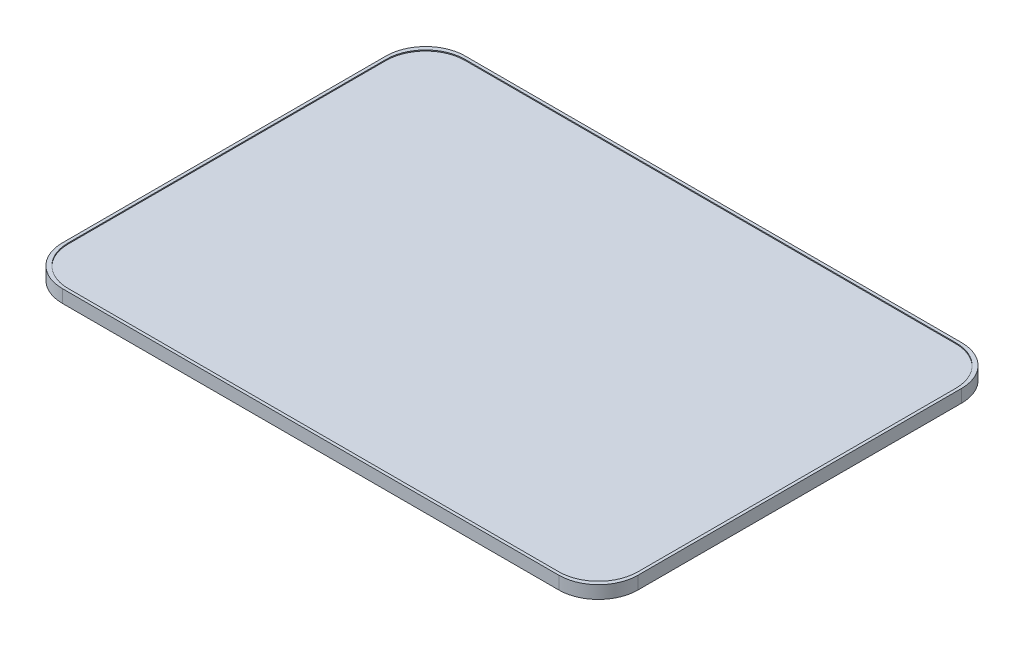
ISO-10303-21;
HEADER;
FILE_DESCRIPTION(('STEP AP214'),'2;1');
FILE_NAME('part.step','',(''),(''),'','','');
FILE_SCHEMA(('AUTOMOTIVE_DESIGN { 1 0 10303 214 1 1 1 1 }'));
ENDSEC;
DATA;
#1=APPLICATION_CONTEXT('core data for automotive mechanical design processes');
#2=APPLICATION_PROTOCOL_DEFINITION('international standard','automotive_design',2000,#1);
#3=PRODUCT_CONTEXT('',#1,'mechanical');
#4=PRODUCT('Part','Part','',(#3));
#5=PRODUCT_RELATED_PRODUCT_CATEGORY('part','',(#4));
#6=PRODUCT_DEFINITION_FORMATION('','',#4);
#7=PRODUCT_DEFINITION_CONTEXT('part definition',#1,'design');
#8=PRODUCT_DEFINITION('design','',#6,#7);
#9=PRODUCT_DEFINITION_SHAPE('','',#8);
#10=(LENGTH_UNIT() NAMED_UNIT(*) SI_UNIT(.MILLI.,.METRE.));
#11=(NAMED_UNIT(*) PLANE_ANGLE_UNIT() SI_UNIT($,.RADIAN.));
#12=(NAMED_UNIT(*) SI_UNIT($,.STERADIAN.) SOLID_ANGLE_UNIT());
#13=UNCERTAINTY_MEASURE_WITH_UNIT(LENGTH_MEASURE(1.E-05),#10,'distance_accuracy_value','');
#14=(GEOMETRIC_REPRESENTATION_CONTEXT(3) GLOBAL_UNCERTAINTY_ASSIGNED_CONTEXT((#13)) GLOBAL_UNIT_ASSIGNED_CONTEXT((#10,
#11,#12)) REPRESENTATION_CONTEXT('',''));
#15=CARTESIAN_POINT('',(0.,0.,0.));
#16=DIRECTION('',(0.,0.,1.));
#17=DIRECTION('',(1.,0.,0.));
#18=AXIS2_PLACEMENT_3D('',#15,#16,#17);
#19=CARTESIAN_POINT('',(291.5,11.,204.));
#20=DIRECTION('',(-1.,0.,0.));
#21=DIRECTION('',(0.,0.,1.));
#22=AXIS2_PLACEMENT_3D('',#19,#20,#21);
#23=PLANE('',#22);
#24=DIRECTION('',(0.,0.,1.));
#25=VECTOR('',#24,1.);
#26=CARTESIAN_POINT('',(291.5,-1.,-204.));
#27=LINE('',#26,#25);
#28=CARTESIAN_POINT('',(291.5,-1.,-164.));
#29=VERTEX_POINT('',#28);
#30=CARTESIAN_POINT('',(291.5,-1.,164.));
#31=VERTEX_POINT('',#30);
#32=EDGE_CURVE('E344',#29,#31,#27,.T.);
#33=ORIENTED_EDGE('',*,*,#32,.F.);
#34=DIRECTION('',(0.,-1.,0.));
#35=VECTOR('',#34,1.);
#36=CARTESIAN_POINT('',(291.5,11.,-164.));
#37=LINE('',#36,#35);
#38=CARTESIAN_POINT('',(291.5,12.,-164.));
#39=VERTEX_POINT('',#38);
#40=EDGE_CURVE('E263',#29,#39,#37,.F.);
#41=ORIENTED_EDGE('',*,*,#40,.T.);
#42=DIRECTION('',(0.,0.,-1.));
#43=VECTOR('',#42,1.);
#44=CARTESIAN_POINT('',(291.5,12.,204.));
#45=LINE('',#44,#43);
#46=CARTESIAN_POINT('',(291.5,12.,164.));
#47=VERTEX_POINT('',#46);
#48=EDGE_CURVE('E227',#47,#39,#45,.T.);
#49=ORIENTED_EDGE('',*,*,#48,.F.);
#50=DIRECTION('',(0.,-1.,0.));
#51=VECTOR('',#50,1.);
#52=CARTESIAN_POINT('',(291.5,11.,164.));
#53=LINE('',#52,#51);
#54=EDGE_CURVE('E260',#47,#31,#53,.T.);
#55=ORIENTED_EDGE('',*,*,#54,.T.);
#56=EDGE_LOOP('',(#33,#41,#49,#55));
#57=FACE_BOUND('',#56,.T.);
#58=ADVANCED_FACE('F36',(#57),#23,.F.);
#59=CARTESIAN_POINT('',(-291.5,11.,-204.));
#60=DIRECTION('',(0.,0.,1.));
#61=DIRECTION('',(1.,0.,0.));
#62=AXIS2_PLACEMENT_3D('',#59,#60,#61);
#63=PLANE('',#62);
#64=DIRECTION('',(1.,0.,0.));
#65=VECTOR('',#64,1.);
#66=CARTESIAN_POINT('',(291.5,-1.,-204.));
#67=LINE('',#66,#65);
#68=CARTESIAN_POINT('',(-251.5,-1.,-204.));
#69=VERTEX_POINT('',#68);
#70=CARTESIAN_POINT('',(251.5,-1.,-204.));
#71=VERTEX_POINT('',#70);
#72=EDGE_CURVE('E345',#69,#71,#67,.T.);
#73=ORIENTED_EDGE('',*,*,#72,.F.);
#74=DIRECTION('',(0.,-1.,0.));
#75=VECTOR('',#74,1.);
#76=CARTESIAN_POINT('',(-251.5,11.,-204.));
#77=LINE('',#76,#75);
#78=CARTESIAN_POINT('',(-251.5,12.,-204.));
#79=VERTEX_POINT('',#78);
#80=EDGE_CURVE('E258',#69,#79,#77,.F.);
#81=ORIENTED_EDGE('',*,*,#80,.T.);
#82=DIRECTION('',(-1.,0.,0.));
#83=VECTOR('',#82,1.);
#84=CARTESIAN_POINT('',(291.5,12.,-204.));
#85=LINE('',#84,#83);
#86=CARTESIAN_POINT('',(251.5,12.,-204.));
#87=VERTEX_POINT('',#86);
#88=EDGE_CURVE('E223',#87,#79,#85,.T.);
#89=ORIENTED_EDGE('',*,*,#88,.F.);
#90=DIRECTION('',(0.,-1.,0.));
#91=VECTOR('',#90,1.);
#92=CARTESIAN_POINT('',(251.5,11.,-204.));
#93=LINE('',#92,#91);
#94=EDGE_CURVE('E255',#87,#71,#93,.T.);
#95=ORIENTED_EDGE('',*,*,#94,.T.);
#96=EDGE_LOOP('',(#73,#81,#89,#95));
#97=FACE_BOUND('',#96,.T.);
#98=ADVANCED_FACE('F334',(#97),#63,.F.);
#99=CARTESIAN_POINT('',(-291.5,11.,204.));
#100=DIRECTION('',(1.,0.,0.));
#101=DIRECTION('',(0.,0.,-1.));
#102=AXIS2_PLACEMENT_3D('',#99,#100,#101);
#103=PLANE('',#102);
#104=DIRECTION('',(0.,0.,1.));
#105=VECTOR('',#104,1.);
#106=CARTESIAN_POINT('',(-291.5,12.,204.));
#107=LINE('',#106,#105);
#108=CARTESIAN_POINT('',(-291.5,12.,-164.));
#109=VERTEX_POINT('',#108);
#110=CARTESIAN_POINT('',(-291.5,12.,164.));
#111=VERTEX_POINT('',#110);
#112=EDGE_CURVE('E369',#109,#111,#107,.T.);
#113=ORIENTED_EDGE('',*,*,#112,.F.);
#114=DIRECTION('',(0.,-1.,0.));
#115=VECTOR('',#114,1.);
#116=CARTESIAN_POINT('',(-291.5,11.,-164.));
#117=LINE('',#116,#115);
#118=CARTESIAN_POINT('',(-291.5,-1.,-164.));
#119=VERTEX_POINT('',#118);
#120=EDGE_CURVE('E252',#109,#119,#117,.T.);
#121=ORIENTED_EDGE('',*,*,#120,.T.);
#122=DIRECTION('',(0.,0.,-1.));
#123=VECTOR('',#122,1.);
#124=CARTESIAN_POINT('',(-291.5,-1.,-204.));
#125=LINE('',#124,#123);
#126=CARTESIAN_POINT('',(-291.5,-1.,164.));
#127=VERTEX_POINT('',#126);
#128=EDGE_CURVE('E353',#127,#119,#125,.T.);
#129=ORIENTED_EDGE('',*,*,#128,.F.);
#130=DIRECTION('',(0.,-1.,0.));
#131=VECTOR('',#130,1.);
#132=CARTESIAN_POINT('',(-291.5,11.,164.));
#133=LINE('',#132,#131);
#134=EDGE_CURVE('E250',#127,#111,#133,.F.);
#135=ORIENTED_EDGE('',*,*,#134,.T.);
#136=EDGE_LOOP('',(#113,#121,#129,#135));
#137=FACE_BOUND('',#136,.T.);
#138=ADVANCED_FACE('F399',(#137),#103,.F.);
#139=CARTESIAN_POINT('',(-291.5,11.,204.));
#140=DIRECTION('',(0.,0.,-1.));
#141=DIRECTION('',(-1.,0.,0.));
#142=AXIS2_PLACEMENT_3D('',#139,#140,#141);
#143=PLANE('',#142);
#144=DIRECTION('',(1.,0.,0.));
#145=VECTOR('',#144,1.);
#146=CARTESIAN_POINT('',(291.5,12.,204.));
#147=LINE('',#146,#145);
#148=CARTESIAN_POINT('',(-251.5,12.,204.));
#149=VERTEX_POINT('',#148);
#150=CARTESIAN_POINT('',(251.5,12.,204.));
#151=VERTEX_POINT('',#150);
#152=EDGE_CURVE('E382',#149,#151,#147,.T.);
#153=ORIENTED_EDGE('',*,*,#152,.F.);
#154=DIRECTION('',(0.,-1.,0.));
#155=VECTOR('',#154,1.);
#156=CARTESIAN_POINT('',(-251.5,11.,204.));
#157=LINE('',#156,#155);
#158=CARTESIAN_POINT('',(-251.5,-1.,204.));
#159=VERTEX_POINT('',#158);
#160=EDGE_CURVE('E267',#149,#159,#157,.T.);
#161=ORIENTED_EDGE('',*,*,#160,.T.);
#162=DIRECTION('',(-1.,0.,0.));
#163=VECTOR('',#162,1.);
#164=CARTESIAN_POINT('',(291.5,-1.,204.));
#165=LINE('',#164,#163);
#166=CARTESIAN_POINT('',(251.5,-1.,204.));
#167=VERTEX_POINT('',#166);
#168=EDGE_CURVE('E348',#167,#159,#165,.T.);
#169=ORIENTED_EDGE('',*,*,#168,.F.);
#170=DIRECTION('',(0.,-1.,0.));
#171=VECTOR('',#170,1.);
#172=CARTESIAN_POINT('',(251.5,11.,204.));
#173=LINE('',#172,#171);
#174=EDGE_CURVE('E265',#167,#151,#173,.F.);
#175=ORIENTED_EDGE('',*,*,#174,.T.);
#176=EDGE_LOOP('',(#153,#161,#169,#175));
#177=FACE_BOUND('',#176,.T.);
#178=ADVANCED_FACE('F392',(#177),#143,.F.);
#179=CARTESIAN_POINT('',(0.,12.,0.));
#180=DIRECTION('',(0.,1.,0.));
#181=DIRECTION('',(0.,0.,1.));
#182=AXIS2_PLACEMENT_3D('',#179,#180,#181);
#183=PLANE('',#182);
#184=ORIENTED_EDGE('',*,*,#88,.T.);
#185=CARTESIAN_POINT('',(-251.5,12.,-164.));
#186=DIRECTION('',(0.,1.,0.));
#187=DIRECTION('',(0.,0.,1.));
#188=AXIS2_PLACEMENT_3D('',#185,#186,#187);
#189=CIRCLE('',#188,40.);
#190=EDGE_CURVE('E11',#79,#109,#189,.T.);
#191=ORIENTED_EDGE('',*,*,#190,.T.);
#192=ORIENTED_EDGE('',*,*,#112,.T.);
#193=CARTESIAN_POINT('',(-251.5,12.,164.));
#194=DIRECTION('',(0.,1.,0.));
#195=DIRECTION('',(0.,0.,1.));
#196=AXIS2_PLACEMENT_3D('',#193,#194,#195);
#197=CIRCLE('',#196,40.);
#198=EDGE_CURVE('E321',#111,#149,#197,.T.);
#199=ORIENTED_EDGE('',*,*,#198,.T.);
#200=ORIENTED_EDGE('',*,*,#152,.T.);
#201=CARTESIAN_POINT('',(251.5,12.,164.));
#202=DIRECTION('',(0.,1.,0.));
#203=DIRECTION('',(0.,0.,1.));
#204=AXIS2_PLACEMENT_3D('',#201,#202,#203);
#205=CIRCLE('',#204,40.);
#206=EDGE_CURVE('E319',#151,#47,#205,.T.);
#207=ORIENTED_EDGE('',*,*,#206,.T.);
#208=ORIENTED_EDGE('',*,*,#48,.T.);
#209=CARTESIAN_POINT('',(251.5,12.,-164.));
#210=DIRECTION('',(0.,1.,0.));
#211=DIRECTION('',(0.,0.,1.));
#212=AXIS2_PLACEMENT_3D('',#209,#210,#211);
#213=CIRCLE('',#212,40.);
#214=EDGE_CURVE('E44',#39,#87,#213,.T.);
#215=ORIENTED_EDGE('',*,*,#214,.T.);
#216=EDGE_LOOP('',(#184,#191,#192,#199,#200,#207,#208,#215));
#217=FACE_BOUND('',#216,.T.);
#218=DIRECTION('',(1.,0.,0.));
#219=VECTOR('',#218,1.);
#220=CARTESIAN_POINT('',(288.5,12.,201.));
#221=LINE('',#220,#219);
#222=CARTESIAN_POINT('',(-248.5,12.,201.));
#223=VERTEX_POINT('',#222);
#224=CARTESIAN_POINT('',(248.5,12.,201.));
#225=VERTEX_POINT('',#224);
#226=EDGE_CURVE('E360',#223,#225,#221,.T.);
#227=ORIENTED_EDGE('',*,*,#226,.F.);
#228=CARTESIAN_POINT('',(-248.5,12.,161.));
#229=DIRECTION('',(0.,1.,0.));
#230=DIRECTION('',(0.,0.,1.));
#231=AXIS2_PLACEMENT_3D('',#228,#229,#230);
#232=CIRCLE('',#231,40.);
#233=CARTESIAN_POINT('',(-288.5,12.,161.));
#234=VERTEX_POINT('',#233);
#235=EDGE_CURVE('E303',#223,#234,#232,.F.);
#236=ORIENTED_EDGE('',*,*,#235,.T.);
#237=DIRECTION('',(0.,0.,1.));
#238=VECTOR('',#237,1.);
#239=CARTESIAN_POINT('',(-288.5,12.,201.));
#240=LINE('',#239,#238);
#241=CARTESIAN_POINT('',(-288.5,12.,-161.));
#242=VERTEX_POINT('',#241);
#243=EDGE_CURVE('E357',#242,#234,#240,.T.);
#244=ORIENTED_EDGE('',*,*,#243,.F.);
#245=CARTESIAN_POINT('',(-248.5,12.,-161.));
#246=DIRECTION('',(0.,1.,0.));
#247=DIRECTION('',(0.,0.,1.));
#248=AXIS2_PLACEMENT_3D('',#245,#246,#247);
#249=CIRCLE('',#248,40.);
#250=CARTESIAN_POINT('',(-248.5,12.,-201.));
#251=VERTEX_POINT('',#250);
#252=EDGE_CURVE('E51',#242,#251,#249,.F.);
#253=ORIENTED_EDGE('',*,*,#252,.T.);
#254=DIRECTION('',(-1.,0.,0.));
#255=VECTOR('',#254,1.);
#256=CARTESIAN_POINT('',(288.5,12.,-201.));
#257=LINE('',#256,#255);
#258=CARTESIAN_POINT('',(248.5,12.,-201.));
#259=VERTEX_POINT('',#258);
#260=EDGE_CURVE('E367',#259,#251,#257,.T.);
#261=ORIENTED_EDGE('',*,*,#260,.F.);
#262=CARTESIAN_POINT('',(248.5,12.,-161.));
#263=DIRECTION('',(0.,1.,0.));
#264=DIRECTION('',(0.,0.,1.));
#265=AXIS2_PLACEMENT_3D('',#262,#263,#264);
#266=CIRCLE('',#265,40.);
#267=CARTESIAN_POINT('',(288.5,12.,-161.));
#268=VERTEX_POINT('',#267);
#269=EDGE_CURVE('E305',#259,#268,#266,.F.);
#270=ORIENTED_EDGE('',*,*,#269,.T.);
#271=DIRECTION('',(0.,0.,-1.));
#272=VECTOR('',#271,1.);
#273=CARTESIAN_POINT('',(288.5,12.,201.));
#274=LINE('',#273,#272);
#275=CARTESIAN_POINT('',(288.5,12.,161.));
#276=VERTEX_POINT('',#275);
#277=EDGE_CURVE('E364',#276,#268,#274,.T.);
#278=ORIENTED_EDGE('',*,*,#277,.F.);
#279=CARTESIAN_POINT('',(248.5,12.,161.));
#280=DIRECTION('',(0.,1.,0.));
#281=DIRECTION('',(0.,0.,1.));
#282=AXIS2_PLACEMENT_3D('',#279,#280,#281);
#283=CIRCLE('',#282,40.);
#284=EDGE_CURVE('E309',#276,#225,#283,.F.);
#285=ORIENTED_EDGE('',*,*,#284,.T.);
#286=EDGE_LOOP('',(#227,#236,#244,#253,#261,#270,#278,#285));
#287=FACE_BOUND('',#286,.T.);
#288=ADVANCED_FACE('F326',(#217,#287),#183,.T.);
#289=CARTESIAN_POINT('',(-288.5,12.,201.));
#290=DIRECTION('',(1.,0.,0.));
#291=DIRECTION('',(0.,0.,-1.));
#292=AXIS2_PLACEMENT_3D('',#289,#290,#291);
#293=PLANE('',#292);
#294=ORIENTED_EDGE('',*,*,#243,.T.);
#295=DIRECTION('',(0.,-1.,0.));
#296=VECTOR('',#295,1.);
#297=CARTESIAN_POINT('',(-288.5,11.,161.));
#298=LINE('',#297,#296);
#299=CARTESIAN_POINT('',(-288.5,11.,161.));
#300=VERTEX_POINT('',#299);
#301=EDGE_CURVE('E272',#234,#300,#298,.T.);
#302=ORIENTED_EDGE('',*,*,#301,.T.);
#303=DIRECTION('',(0.,0.,1.));
#304=VECTOR('',#303,1.);
#305=CARTESIAN_POINT('',(-288.5,11.,201.));
#306=LINE('',#305,#304);
#307=CARTESIAN_POINT('',(-288.5,11.,-161.));
#308=VERTEX_POINT('',#307);
#309=EDGE_CURVE('E351',#308,#300,#306,.T.);
#310=ORIENTED_EDGE('',*,*,#309,.F.);
#311=DIRECTION('',(0.,-1.,0.));
#312=VECTOR('',#311,1.);
#313=CARTESIAN_POINT('',(-288.5,12.,-161.));
#314=LINE('',#313,#312);
#315=EDGE_CURVE('E270',#308,#242,#314,.F.);
#316=ORIENTED_EDGE('',*,*,#315,.T.);
#317=EDGE_LOOP('',(#294,#302,#310,#316));
#318=FACE_BOUND('',#317,.T.);
#319=ADVANCED_FACE('F470',(#318),#293,.T.);
#320=CARTESIAN_POINT('',(288.5,12.,201.));
#321=DIRECTION('',(0.,0.,-1.));
#322=DIRECTION('',(-1.,0.,0.));
#323=AXIS2_PLACEMENT_3D('',#320,#321,#322);
#324=PLANE('',#323);
#325=DIRECTION('',(1.,0.,0.));
#326=VECTOR('',#325,1.);
#327=CARTESIAN_POINT('',(288.5,11.,201.));
#328=LINE('',#327,#326);
#329=CARTESIAN_POINT('',(-248.5,11.,201.));
#330=VERTEX_POINT('',#329);
#331=CARTESIAN_POINT('',(248.5,11.,201.));
#332=VERTEX_POINT('',#331);
#333=EDGE_CURVE('E372',#330,#332,#328,.T.);
#334=ORIENTED_EDGE('',*,*,#333,.F.);
#335=DIRECTION('',(0.,-1.,0.));
#336=VECTOR('',#335,1.);
#337=CARTESIAN_POINT('',(-248.5,12.,201.));
#338=LINE('',#337,#336);
#339=EDGE_CURVE('E286',#330,#223,#338,.F.);
#340=ORIENTED_EDGE('',*,*,#339,.T.);
#341=ORIENTED_EDGE('',*,*,#226,.T.);
#342=DIRECTION('',(0.,-1.,0.));
#343=VECTOR('',#342,1.);
#344=CARTESIAN_POINT('',(248.5,11.,201.));
#345=LINE('',#344,#343);
#346=EDGE_CURVE('E283',#225,#332,#345,.T.);
#347=ORIENTED_EDGE('',*,*,#346,.T.);
#348=EDGE_LOOP('',(#334,#340,#341,#347));
#349=FACE_BOUND('',#348,.T.);
#350=ADVANCED_FACE('F473',(#349),#324,.T.);
#351=CARTESIAN_POINT('',(288.5,12.,201.));
#352=DIRECTION('',(-1.,0.,0.));
#353=DIRECTION('',(0.,0.,1.));
#354=AXIS2_PLACEMENT_3D('',#351,#352,#353);
#355=PLANE('',#354);
#356=ORIENTED_EDGE('',*,*,#277,.T.);
#357=DIRECTION('',(0.,-1.,0.));
#358=VECTOR('',#357,1.);
#359=CARTESIAN_POINT('',(288.5,11.,-161.));
#360=LINE('',#359,#358);
#361=CARTESIAN_POINT('',(288.5,11.,-161.));
#362=VERTEX_POINT('',#361);
#363=EDGE_CURVE('E290',#268,#362,#360,.T.);
#364=ORIENTED_EDGE('',*,*,#363,.T.);
#365=DIRECTION('',(0.,0.,-1.));
#366=VECTOR('',#365,1.);
#367=CARTESIAN_POINT('',(288.5,11.,201.));
#368=LINE('',#367,#366);
#369=CARTESIAN_POINT('',(288.5,11.,161.));
#370=VERTEX_POINT('',#369);
#371=EDGE_CURVE('E375',#370,#362,#368,.T.);
#372=ORIENTED_EDGE('',*,*,#371,.F.);
#373=DIRECTION('',(0.,-1.,0.));
#374=VECTOR('',#373,1.);
#375=CARTESIAN_POINT('',(288.5,12.,161.));
#376=LINE('',#375,#374);
#377=EDGE_CURVE('E288',#370,#276,#376,.F.);
#378=ORIENTED_EDGE('',*,*,#377,.T.);
#379=EDGE_LOOP('',(#356,#364,#372,#378));
#380=FACE_BOUND('',#379,.T.);
#381=ADVANCED_FACE('F477',(#380),#355,.T.);
#382=CARTESIAN_POINT('',(288.5,12.,-201.));
#383=DIRECTION('',(0.,0.,1.));
#384=DIRECTION('',(1.,0.,0.));
#385=AXIS2_PLACEMENT_3D('',#382,#383,#384);
#386=PLANE('',#385);
#387=DIRECTION('',(-1.,0.,0.));
#388=VECTOR('',#387,1.);
#389=CARTESIAN_POINT('',(288.5,11.,-201.));
#390=LINE('',#389,#388);
#391=CARTESIAN_POINT('',(248.5,11.,-201.));
#392=VERTEX_POINT('',#391);
#393=CARTESIAN_POINT('',(-248.5,11.,-201.));
#394=VERTEX_POINT('',#393);
#395=EDGE_CURVE('E361',#392,#394,#390,.T.);
#396=ORIENTED_EDGE('',*,*,#395,.F.);
#397=DIRECTION('',(0.,-1.,0.));
#398=VECTOR('',#397,1.);
#399=CARTESIAN_POINT('',(248.5,12.,-201.));
#400=LINE('',#399,#398);
#401=EDGE_CURVE('E58',#392,#259,#400,.F.);
#402=ORIENTED_EDGE('',*,*,#401,.T.);
#403=ORIENTED_EDGE('',*,*,#260,.T.);
#404=DIRECTION('',(0.,-1.,0.));
#405=VECTOR('',#404,1.);
#406=CARTESIAN_POINT('',(-248.5,11.,-201.));
#407=LINE('',#406,#405);
#408=EDGE_CURVE('E293',#251,#394,#407,.T.);
#409=ORIENTED_EDGE('',*,*,#408,.T.);
#410=EDGE_LOOP('',(#396,#402,#403,#409));
#411=FACE_BOUND('',#410,.T.);
#412=ADVANCED_FACE('F466',(#411),#386,.T.);
#413=CARTESIAN_POINT('',(0.,11.,0.));
#414=DIRECTION('',(0.,-1.,0.));
#415=DIRECTION('',(0.,0.,-1.));
#416=AXIS2_PLACEMENT_3D('',#413,#414,#415);
#417=PLANE('',#416);
#418=ORIENTED_EDGE('',*,*,#309,.T.);
#419=CARTESIAN_POINT('',(-248.5,11.,161.));
#420=DIRECTION('',(0.,-1.,0.));
#421=DIRECTION('',(0.,0.,-1.));
#422=AXIS2_PLACEMENT_3D('',#419,#420,#421);
#423=CIRCLE('',#422,40.);
#424=EDGE_CURVE('E281',#300,#330,#423,.F.);
#425=ORIENTED_EDGE('',*,*,#424,.T.);
#426=ORIENTED_EDGE('',*,*,#333,.T.);
#427=CARTESIAN_POINT('',(248.5,11.,161.));
#428=DIRECTION('',(0.,-1.,0.));
#429=DIRECTION('',(0.,0.,-1.));
#430=AXIS2_PLACEMENT_3D('',#427,#428,#429);
#431=CIRCLE('',#430,40.);
#432=EDGE_CURVE('E275',#332,#370,#431,.F.);
#433=ORIENTED_EDGE('',*,*,#432,.T.);
#434=ORIENTED_EDGE('',*,*,#371,.T.);
#435=CARTESIAN_POINT('',(248.5,11.,-161.));
#436=DIRECTION('',(0.,-1.,0.));
#437=DIRECTION('',(0.,0.,-1.));
#438=AXIS2_PLACEMENT_3D('',#435,#436,#437);
#439=CIRCLE('',#438,40.);
#440=EDGE_CURVE('E279',#362,#392,#439,.F.);
#441=ORIENTED_EDGE('',*,*,#440,.T.);
#442=ORIENTED_EDGE('',*,*,#395,.T.);
#443=CARTESIAN_POINT('',(-248.5,11.,-161.));
#444=DIRECTION('',(0.,-1.,0.));
#445=DIRECTION('',(0.,0.,-1.));
#446=AXIS2_PLACEMENT_3D('',#443,#444,#445);
#447=CIRCLE('',#446,40.);
#448=EDGE_CURVE('E277',#394,#308,#447,.F.);
#449=ORIENTED_EDGE('',*,*,#448,.T.);
#450=EDGE_LOOP('',(#418,#425,#426,#433,#434,#441,#442,#449));
#451=FACE_BOUND('',#450,.T.);
#452=ADVANCED_FACE('F463',(#451),#417,.F.);
#453=CARTESIAN_POINT('',(0.,-1.,0.));
#454=DIRECTION('',(0.,-1.,0.));
#455=DIRECTION('',(0.,0.,-1.));
#456=AXIS2_PLACEMENT_3D('',#453,#454,#455);
#457=PLANE('',#456);
#458=ORIENTED_EDGE('',*,*,#128,.T.);
#459=CARTESIAN_POINT('',(-251.5,-1.,-164.));
#460=DIRECTION('',(0.,-1.,0.));
#461=DIRECTION('',(0.,0.,-1.));
#462=AXIS2_PLACEMENT_3D('',#459,#460,#461);
#463=CIRCLE('',#462,40.);
#464=EDGE_CURVE('E317',#119,#69,#463,.T.);
#465=ORIENTED_EDGE('',*,*,#464,.T.);
#466=ORIENTED_EDGE('',*,*,#72,.T.);
#467=CARTESIAN_POINT('',(251.5,-1.,-164.));
#468=DIRECTION('',(0.,-1.,0.));
#469=DIRECTION('',(0.,0.,-1.));
#470=AXIS2_PLACEMENT_3D('',#467,#468,#469);
#471=CIRCLE('',#470,40.);
#472=EDGE_CURVE('E315',#71,#29,#471,.T.);
#473=ORIENTED_EDGE('',*,*,#472,.T.);
#474=ORIENTED_EDGE('',*,*,#32,.T.);
#475=CARTESIAN_POINT('',(251.5,-1.,164.));
#476=DIRECTION('',(0.,-1.,0.));
#477=DIRECTION('',(0.,0.,-1.));
#478=AXIS2_PLACEMENT_3D('',#475,#476,#477);
#479=CIRCLE('',#478,40.);
#480=EDGE_CURVE('E311',#31,#167,#479,.T.);
#481=ORIENTED_EDGE('',*,*,#480,.T.);
#482=ORIENTED_EDGE('',*,*,#168,.T.);
#483=CARTESIAN_POINT('',(-251.5,-1.,164.));
#484=DIRECTION('',(0.,-1.,0.));
#485=DIRECTION('',(0.,0.,-1.));
#486=AXIS2_PLACEMENT_3D('',#483,#484,#485);
#487=CIRCLE('',#486,40.);
#488=EDGE_CURVE('E313',#159,#127,#487,.T.);
#489=ORIENTED_EDGE('',*,*,#488,.T.);
#490=EDGE_LOOP('',(#458,#465,#466,#473,#474,#481,#482,#489));
#491=FACE_BOUND('',#490,.T.);
#492=DIRECTION('',(1.,0.,0.));
#493=VECTOR('',#492,1.);
#494=CARTESIAN_POINT('',(288.5,-1.,-201.));
#495=LINE('',#494,#493);
#496=CARTESIAN_POINT('',(-248.5,-1.,-201.));
#497=VERTEX_POINT('',#496);
#498=CARTESIAN_POINT('',(248.5,-1.,-201.));
#499=VERTEX_POINT('',#498);
#500=EDGE_CURVE('E414',#497,#499,#495,.T.);
#501=ORIENTED_EDGE('',*,*,#500,.F.);
#502=CARTESIAN_POINT('',(-248.5,-1.,-161.));
#503=DIRECTION('',(0.,-1.,0.));
#504=DIRECTION('',(0.,0.,-1.));
#505=AXIS2_PLACEMENT_3D('',#502,#503,#504);
#506=CIRCLE('',#505,40.);
#507=CARTESIAN_POINT('',(-288.5,-1.,-161.));
#508=VERTEX_POINT('',#507);
#509=EDGE_CURVE('E301',#497,#508,#506,.F.);
#510=ORIENTED_EDGE('',*,*,#509,.T.);
#511=DIRECTION('',(0.,0.,-1.));
#512=VECTOR('',#511,1.);
#513=CARTESIAN_POINT('',(-288.5,-1.,-201.));
#514=LINE('',#513,#512);
#515=CARTESIAN_POINT('',(-288.5,-1.,161.));
#516=VERTEX_POINT('',#515);
#517=EDGE_CURVE('E218',#516,#508,#514,.T.);
#518=ORIENTED_EDGE('',*,*,#517,.F.);
#519=CARTESIAN_POINT('',(-248.5,-1.,161.));
#520=DIRECTION('',(0.,-1.,0.));
#521=DIRECTION('',(0.,0.,-1.));
#522=AXIS2_PLACEMENT_3D('',#519,#520,#521);
#523=CIRCLE('',#522,40.);
#524=CARTESIAN_POINT('',(-248.5,-1.,201.));
#525=VERTEX_POINT('',#524);
#526=EDGE_CURVE('E297',#516,#525,#523,.F.);
#527=ORIENTED_EDGE('',*,*,#526,.T.);
#528=DIRECTION('',(-1.,0.,0.));
#529=VECTOR('',#528,1.);
#530=CARTESIAN_POINT('',(288.5,-1.,201.));
#531=LINE('',#530,#529);
#532=CARTESIAN_POINT('',(248.5,-1.,201.));
#533=VERTEX_POINT('',#532);
#534=EDGE_CURVE('E401',#533,#525,#531,.T.);
#535=ORIENTED_EDGE('',*,*,#534,.F.);
#536=CARTESIAN_POINT('',(248.5,-1.,161.));
#537=DIRECTION('',(0.,-1.,0.));
#538=DIRECTION('',(0.,0.,-1.));
#539=AXIS2_PLACEMENT_3D('',#536,#537,#538);
#540=CIRCLE('',#539,40.);
#541=CARTESIAN_POINT('',(288.5,-1.,161.));
#542=VERTEX_POINT('',#541);
#543=EDGE_CURVE('E222',#533,#542,#540,.F.);
#544=ORIENTED_EDGE('',*,*,#543,.T.);
#545=DIRECTION('',(0.,0.,1.));
#546=VECTOR('',#545,1.);
#547=CARTESIAN_POINT('',(288.5,-1.,-201.));
#548=LINE('',#547,#546);
#549=CARTESIAN_POINT('',(288.5,-1.,-161.));
#550=VERTEX_POINT('',#549);
#551=EDGE_CURVE('E402',#550,#542,#548,.T.);
#552=ORIENTED_EDGE('',*,*,#551,.F.);
#553=CARTESIAN_POINT('',(248.5,-1.,-161.));
#554=DIRECTION('',(0.,-1.,0.));
#555=DIRECTION('',(0.,0.,-1.));
#556=AXIS2_PLACEMENT_3D('',#553,#554,#555);
#557=CIRCLE('',#556,40.);
#558=EDGE_CURVE('E299',#550,#499,#557,.F.);
#559=ORIENTED_EDGE('',*,*,#558,.T.);
#560=EDGE_LOOP('',(#501,#510,#518,#527,#535,#544,#552,#559));
#561=FACE_BOUND('',#560,.T.);
#562=ADVANCED_FACE('F342',(#491,#561),#457,.T.);
#563=CARTESIAN_POINT('',(-288.5,-1.,-201.));
#564=DIRECTION('',(1.,0.,0.));
#565=DIRECTION('',(0.,0.,-1.));
#566=AXIS2_PLACEMENT_3D('',#563,#564,#565);
#567=PLANE('',#566);
#568=DIRECTION('',(0.,0.,-1.));
#569=VECTOR('',#568,1.);
#570=CARTESIAN_POINT('',(-288.5,0.,-201.));
#571=LINE('',#570,#569);
#572=CARTESIAN_POINT('',(-288.5,0.,161.));
#573=VERTEX_POINT('',#572);
#574=CARTESIAN_POINT('',(-288.5,0.,-161.));
#575=VERTEX_POINT('',#574);
#576=EDGE_CURVE('E409',#573,#575,#571,.T.);
#577=ORIENTED_EDGE('',*,*,#576,.F.);
#578=DIRECTION('',(0.,1.,0.));
#579=VECTOR('',#578,1.);
#580=CARTESIAN_POINT('',(-288.5,-1.,161.));
#581=LINE('',#580,#579);
#582=EDGE_CURVE('E239',#573,#516,#581,.F.);
#583=ORIENTED_EDGE('',*,*,#582,.T.);
#584=ORIENTED_EDGE('',*,*,#517,.T.);
#585=DIRECTION('',(0.,1.,0.));
#586=VECTOR('',#585,1.);
#587=CARTESIAN_POINT('',(-288.5,0.,-161.));
#588=LINE('',#587,#586);
#589=EDGE_CURVE('E236',#508,#575,#588,.T.);
#590=ORIENTED_EDGE('',*,*,#589,.T.);
#591=EDGE_LOOP('',(#577,#583,#584,#590));
#592=FACE_BOUND('',#591,.T.);
#593=ADVANCED_FACE('F422',(#592),#567,.T.);
#594=CARTESIAN_POINT('',(288.5,-1.,-201.));
#595=DIRECTION('',(0.,0.,1.));
#596=DIRECTION('',(1.,0.,0.));
#597=AXIS2_PLACEMENT_3D('',#594,#595,#596);
#598=PLANE('',#597);
#599=ORIENTED_EDGE('',*,*,#500,.T.);
#600=DIRECTION('',(0.,1.,0.));
#601=VECTOR('',#600,1.);
#602=CARTESIAN_POINT('',(248.5,0.,-201.));
#603=LINE('',#602,#601);
#604=CARTESIAN_POINT('',(248.5,0.,-201.));
#605=VERTEX_POINT('',#604);
#606=EDGE_CURVE('E243',#499,#605,#603,.T.);
#607=ORIENTED_EDGE('',*,*,#606,.T.);
#608=DIRECTION('',(1.,0.,0.));
#609=VECTOR('',#608,1.);
#610=CARTESIAN_POINT('',(288.5,0.,-201.));
#611=LINE('',#610,#609);
#612=CARTESIAN_POINT('',(-248.5,0.,-201.));
#613=VERTEX_POINT('',#612);
#614=EDGE_CURVE('E406',#613,#605,#611,.T.);
#615=ORIENTED_EDGE('',*,*,#614,.F.);
#616=DIRECTION('',(0.,1.,0.));
#617=VECTOR('',#616,1.);
#618=CARTESIAN_POINT('',(-248.5,-1.,-201.));
#619=LINE('',#618,#617);
#620=EDGE_CURVE('E241',#613,#497,#619,.F.);
#621=ORIENTED_EDGE('',*,*,#620,.T.);
#622=EDGE_LOOP('',(#599,#607,#615,#621));
#623=FACE_BOUND('',#622,.T.);
#624=ADVANCED_FACE('F431',(#623),#598,.T.);
#625=CARTESIAN_POINT('',(288.5,-1.,-201.));
#626=DIRECTION('',(-1.,0.,0.));
#627=DIRECTION('',(0.,0.,1.));
#628=AXIS2_PLACEMENT_3D('',#625,#626,#627);
#629=PLANE('',#628);
#630=DIRECTION('',(0.,0.,1.));
#631=VECTOR('',#630,1.);
#632=CARTESIAN_POINT('',(288.5,0.,-201.));
#633=LINE('',#632,#631);
#634=CARTESIAN_POINT('',(288.5,0.,-161.));
#635=VERTEX_POINT('',#634);
#636=CARTESIAN_POINT('',(288.5,0.,161.));
#637=VERTEX_POINT('',#636);
#638=EDGE_CURVE('E203',#635,#637,#633,.T.);
#639=ORIENTED_EDGE('',*,*,#638,.F.);
#640=DIRECTION('',(0.,1.,0.));
#641=VECTOR('',#640,1.);
#642=CARTESIAN_POINT('',(288.5,-1.,-161.));
#643=LINE('',#642,#641);
#644=EDGE_CURVE('E248',#635,#550,#643,.F.);
#645=ORIENTED_EDGE('',*,*,#644,.T.);
#646=ORIENTED_EDGE('',*,*,#551,.T.);
#647=DIRECTION('',(0.,1.,0.));
#648=VECTOR('',#647,1.);
#649=CARTESIAN_POINT('',(288.5,0.,161.));
#650=LINE('',#649,#648);
#651=EDGE_CURVE('E246',#542,#637,#650,.T.);
#652=ORIENTED_EDGE('',*,*,#651,.T.);
#653=EDGE_LOOP('',(#639,#645,#646,#652));
#654=FACE_BOUND('',#653,.T.);
#655=ADVANCED_FACE('F439',(#654),#629,.T.);
#656=CARTESIAN_POINT('',(288.5,-1.,201.));
#657=DIRECTION('',(0.,0.,-1.));
#658=DIRECTION('',(-1.,0.,0.));
#659=AXIS2_PLACEMENT_3D('',#656,#657,#658);
#660=PLANE('',#659);
#661=ORIENTED_EDGE('',*,*,#534,.T.);
#662=DIRECTION('',(0.,1.,0.));
#663=VECTOR('',#662,1.);
#664=CARTESIAN_POINT('',(-248.5,0.,201.));
#665=LINE('',#664,#663);
#666=CARTESIAN_POINT('',(-248.5,0.,201.));
#667=VERTEX_POINT('',#666);
#668=EDGE_CURVE('E209',#525,#667,#665,.T.);
#669=ORIENTED_EDGE('',*,*,#668,.T.);
#670=DIRECTION('',(-1.,0.,0.));
#671=VECTOR('',#670,1.);
#672=CARTESIAN_POINT('',(288.5,0.,201.));
#673=LINE('',#672,#671);
#674=CARTESIAN_POINT('',(248.5,0.,201.));
#675=VERTEX_POINT('',#674);
#676=EDGE_CURVE('E201',#675,#667,#673,.T.);
#677=ORIENTED_EDGE('',*,*,#676,.F.);
#678=DIRECTION('',(0.,1.,0.));
#679=VECTOR('',#678,1.);
#680=CARTESIAN_POINT('',(248.5,-1.,201.));
#681=LINE('',#680,#679);
#682=EDGE_CURVE('E215',#675,#533,#681,.F.);
#683=ORIENTED_EDGE('',*,*,#682,.T.);
#684=EDGE_LOOP('',(#661,#669,#677,#683));
#685=FACE_BOUND('',#684,.T.);
#686=ADVANCED_FACE('F214',(#685),#660,.T.);
#687=CARTESIAN_POINT('',(0.,0.,0.));
#688=DIRECTION('',(0.,-1.,0.));
#689=DIRECTION('',(0.,0.,-1.));
#690=AXIS2_PLACEMENT_3D('',#687,#688,#689);
#691=PLANE('',#690);
#692=ORIENTED_EDGE('',*,*,#676,.T.);
#693=CARTESIAN_POINT('',(-248.5,0.,161.));
#694=DIRECTION('',(0.,-1.,0.));
#695=DIRECTION('',(0.,0.,-1.));
#696=AXIS2_PLACEMENT_3D('',#693,#694,#695);
#697=CIRCLE('',#696,40.);
#698=EDGE_CURVE('E234',#667,#573,#697,.T.);
#699=ORIENTED_EDGE('',*,*,#698,.T.);
#700=ORIENTED_EDGE('',*,*,#576,.T.);
#701=CARTESIAN_POINT('',(-248.5,0.,-161.));
#702=DIRECTION('',(0.,-1.,0.));
#703=DIRECTION('',(0.,0.,-1.));
#704=AXIS2_PLACEMENT_3D('',#701,#702,#703);
#705=CIRCLE('',#704,40.);
#706=EDGE_CURVE('E208',#575,#613,#705,.T.);
#707=ORIENTED_EDGE('',*,*,#706,.T.);
#708=ORIENTED_EDGE('',*,*,#614,.T.);
#709=CARTESIAN_POINT('',(248.5,0.,-161.));
#710=DIRECTION('',(0.,-1.,0.));
#711=DIRECTION('',(0.,0.,-1.));
#712=AXIS2_PLACEMENT_3D('',#709,#710,#711);
#713=CIRCLE('',#712,40.);
#714=EDGE_CURVE('E232',#605,#635,#713,.T.);
#715=ORIENTED_EDGE('',*,*,#714,.T.);
#716=ORIENTED_EDGE('',*,*,#638,.T.);
#717=CARTESIAN_POINT('',(248.5,0.,161.));
#718=DIRECTION('',(0.,-1.,0.));
#719=DIRECTION('',(0.,0.,-1.));
#720=AXIS2_PLACEMENT_3D('',#717,#718,#719);
#721=CIRCLE('',#720,40.);
#722=EDGE_CURVE('E198',#637,#675,#721,.T.);
#723=ORIENTED_EDGE('',*,*,#722,.T.);
#724=EDGE_LOOP('',(#692,#699,#700,#707,#708,#715,#716,#723));
#725=FACE_BOUND('',#724,.T.);
#726=ADVANCED_FACE('F200',(#725),#691,.T.);
#727=CARTESIAN_POINT('',(-248.5,-1.,161.));
#728=DIRECTION('',(0.,-1.,0.));
#729=DIRECTION('',(0.,0.,-1.));
#730=AXIS2_PLACEMENT_3D('',#727,#728,#729);
#731=CYLINDRICAL_SURFACE('',#730,40.);
#732=ORIENTED_EDGE('',*,*,#526,.F.);
#733=ORIENTED_EDGE('',*,*,#582,.F.);
#734=ORIENTED_EDGE('',*,*,#698,.F.);
#735=ORIENTED_EDGE('',*,*,#668,.F.);
#736=EDGE_LOOP('',(#732,#733,#734,#735));
#737=FACE_BOUND('',#736,.T.);
#738=ADVANCED_FACE('F442',(#737),#731,.F.);
#739=CARTESIAN_POINT('',(248.5,-1.,-161.));
#740=DIRECTION('',(0.,-1.,0.));
#741=DIRECTION('',(0.,0.,-1.));
#742=AXIS2_PLACEMENT_3D('',#739,#740,#741);
#743=CYLINDRICAL_SURFACE('',#742,40.);
#744=ORIENTED_EDGE('',*,*,#558,.F.);
#745=ORIENTED_EDGE('',*,*,#644,.F.);
#746=ORIENTED_EDGE('',*,*,#714,.F.);
#747=ORIENTED_EDGE('',*,*,#606,.F.);
#748=EDGE_LOOP('',(#744,#745,#746,#747));
#749=FACE_BOUND('',#748,.T.);
#750=ADVANCED_FACE('F436',(#749),#743,.F.);
#751=CARTESIAN_POINT('',(-248.5,-1.,-161.));
#752=DIRECTION('',(0.,-1.,0.));
#753=DIRECTION('',(0.,0.,-1.));
#754=AXIS2_PLACEMENT_3D('',#751,#752,#753);
#755=CYLINDRICAL_SURFACE('',#754,40.);
#756=ORIENTED_EDGE('',*,*,#509,.F.);
#757=ORIENTED_EDGE('',*,*,#620,.F.);
#758=ORIENTED_EDGE('',*,*,#706,.F.);
#759=ORIENTED_EDGE('',*,*,#589,.F.);
#760=EDGE_LOOP('',(#756,#757,#758,#759));
#761=FACE_BOUND('',#760,.T.);
#762=ADVANCED_FACE('F427',(#761),#755,.F.);
#763=CARTESIAN_POINT('',(-251.5,11.,-164.));
#764=DIRECTION('',(0.,-1.,0.));
#765=DIRECTION('',(0.,0.,-1.));
#766=AXIS2_PLACEMENT_3D('',#763,#764,#765);
#767=CYLINDRICAL_SURFACE('',#766,40.);
#768=ORIENTED_EDGE('',*,*,#190,.F.);
#769=ORIENTED_EDGE('',*,*,#80,.F.);
#770=ORIENTED_EDGE('',*,*,#464,.F.);
#771=ORIENTED_EDGE('',*,*,#120,.F.);
#772=EDGE_LOOP('',(#768,#769,#770,#771));
#773=FACE_BOUND('',#772,.T.);
#774=ADVANCED_FACE('F519',(#773),#767,.T.);
#775=CARTESIAN_POINT('',(251.5,11.,-164.));
#776=DIRECTION('',(0.,-1.,0.));
#777=DIRECTION('',(0.,0.,-1.));
#778=AXIS2_PLACEMENT_3D('',#775,#776,#777);
#779=CYLINDRICAL_SURFACE('',#778,40.);
#780=ORIENTED_EDGE('',*,*,#214,.F.);
#781=ORIENTED_EDGE('',*,*,#40,.F.);
#782=ORIENTED_EDGE('',*,*,#472,.F.);
#783=ORIENTED_EDGE('',*,*,#94,.F.);
#784=EDGE_LOOP('',(#780,#781,#782,#783));
#785=FACE_BOUND('',#784,.T.);
#786=ADVANCED_FACE('F337',(#785),#779,.T.);
#787=CARTESIAN_POINT('',(-251.5,11.,164.));
#788=DIRECTION('',(0.,-1.,0.));
#789=DIRECTION('',(0.,0.,-1.));
#790=AXIS2_PLACEMENT_3D('',#787,#788,#789);
#791=CYLINDRICAL_SURFACE('',#790,40.);
#792=ORIENTED_EDGE('',*,*,#198,.F.);
#793=ORIENTED_EDGE('',*,*,#134,.F.);
#794=ORIENTED_EDGE('',*,*,#488,.F.);
#795=ORIENTED_EDGE('',*,*,#160,.F.);
#796=EDGE_LOOP('',(#792,#793,#794,#795));
#797=FACE_BOUND('',#796,.T.);
#798=ADVANCED_FACE('F394',(#797),#791,.T.);
#799=CARTESIAN_POINT('',(-248.5,12.,161.));
#800=DIRECTION('',(0.,1.,0.));
#801=DIRECTION('',(0.,0.,1.));
#802=AXIS2_PLACEMENT_3D('',#799,#800,#801);
#803=CYLINDRICAL_SURFACE('',#802,40.);
#804=ORIENTED_EDGE('',*,*,#235,.F.);
#805=ORIENTED_EDGE('',*,*,#339,.F.);
#806=ORIENTED_EDGE('',*,*,#424,.F.);
#807=ORIENTED_EDGE('',*,*,#301,.F.);
#808=EDGE_LOOP('',(#804,#805,#806,#807));
#809=FACE_BOUND('',#808,.T.);
#810=ADVANCED_FACE('F548',(#809),#803,.F.);
#811=CARTESIAN_POINT('',(248.5,12.,-161.));
#812=DIRECTION('',(0.,1.,0.));
#813=DIRECTION('',(0.,0.,1.));
#814=AXIS2_PLACEMENT_3D('',#811,#812,#813);
#815=CYLINDRICAL_SURFACE('',#814,40.);
#816=ORIENTED_EDGE('',*,*,#269,.F.);
#817=ORIENTED_EDGE('',*,*,#401,.F.);
#818=ORIENTED_EDGE('',*,*,#440,.F.);
#819=ORIENTED_EDGE('',*,*,#363,.F.);
#820=EDGE_LOOP('',(#816,#817,#818,#819));
#821=FACE_BOUND('',#820,.T.);
#822=ADVANCED_FACE('F558',(#821),#815,.F.);
#823=CARTESIAN_POINT('',(-248.5,12.,-161.));
#824=DIRECTION('',(0.,1.,0.));
#825=DIRECTION('',(0.,0.,1.));
#826=AXIS2_PLACEMENT_3D('',#823,#824,#825);
#827=CYLINDRICAL_SURFACE('',#826,40.);
#828=ORIENTED_EDGE('',*,*,#252,.F.);
#829=ORIENTED_EDGE('',*,*,#315,.F.);
#830=ORIENTED_EDGE('',*,*,#448,.F.);
#831=ORIENTED_EDGE('',*,*,#408,.F.);
#832=EDGE_LOOP('',(#828,#829,#830,#831));
#833=FACE_BOUND('',#832,.T.);
#834=ADVANCED_FACE('F569',(#833),#827,.F.);
#835=CARTESIAN_POINT('',(248.5,-1.,161.));
#836=DIRECTION('',(0.,-1.,0.));
#837=DIRECTION('',(0.,0.,-1.));
#838=AXIS2_PLACEMENT_3D('',#835,#836,#837);
#839=CYLINDRICAL_SURFACE('',#838,40.);
#840=ORIENTED_EDGE('',*,*,#543,.F.);
#841=ORIENTED_EDGE('',*,*,#682,.F.);
#842=ORIENTED_EDGE('',*,*,#722,.F.);
#843=ORIENTED_EDGE('',*,*,#651,.F.);
#844=EDGE_LOOP('',(#840,#841,#842,#843));
#845=FACE_BOUND('',#844,.T.);
#846=ADVANCED_FACE('F221',(#845),#839,.F.);
#847=CARTESIAN_POINT('',(248.5,12.,161.));
#848=DIRECTION('',(0.,1.,0.));
#849=DIRECTION('',(0.,0.,1.));
#850=AXIS2_PLACEMENT_3D('',#847,#848,#849);
#851=CYLINDRICAL_SURFACE('',#850,40.);
#852=ORIENTED_EDGE('',*,*,#284,.F.);
#853=ORIENTED_EDGE('',*,*,#377,.F.);
#854=ORIENTED_EDGE('',*,*,#432,.F.);
#855=ORIENTED_EDGE('',*,*,#346,.F.);
#856=EDGE_LOOP('',(#852,#853,#854,#855));
#857=FACE_BOUND('',#856,.T.);
#858=ADVANCED_FACE('F590',(#857),#851,.F.);
#859=CARTESIAN_POINT('',(251.5,11.,164.));
#860=DIRECTION('',(0.,-1.,0.));
#861=DIRECTION('',(0.,0.,-1.));
#862=AXIS2_PLACEMENT_3D('',#859,#860,#861);
#863=CYLINDRICAL_SURFACE('',#862,40.);
#864=ORIENTED_EDGE('',*,*,#206,.F.);
#865=ORIENTED_EDGE('',*,*,#174,.F.);
#866=ORIENTED_EDGE('',*,*,#480,.F.);
#867=ORIENTED_EDGE('',*,*,#54,.F.);
#868=EDGE_LOOP('',(#864,#865,#866,#867));
#869=FACE_BOUND('',#868,.T.);
#870=ADVANCED_FACE('F38',(#869),#863,.T.);
#871=CLOSED_SHELL('',(#58,#98,#138,#178,#288,#319,#350,#381,#412,#452,#562,#593,#624,#655,#686,
#726,#738,#750,#762,#774,#786,#798,#810,#822,#834,#846,#858,#870));
#872=MANIFOLD_SOLID_BREP('B2',#871);
#873=ADVANCED_BREP_SHAPE_REPRESENTATION('',(#18,#872),#14);
#874=SHAPE_DEFINITION_REPRESENTATION(#9,#873);
ENDSEC;
END-ISO-10303-21;
